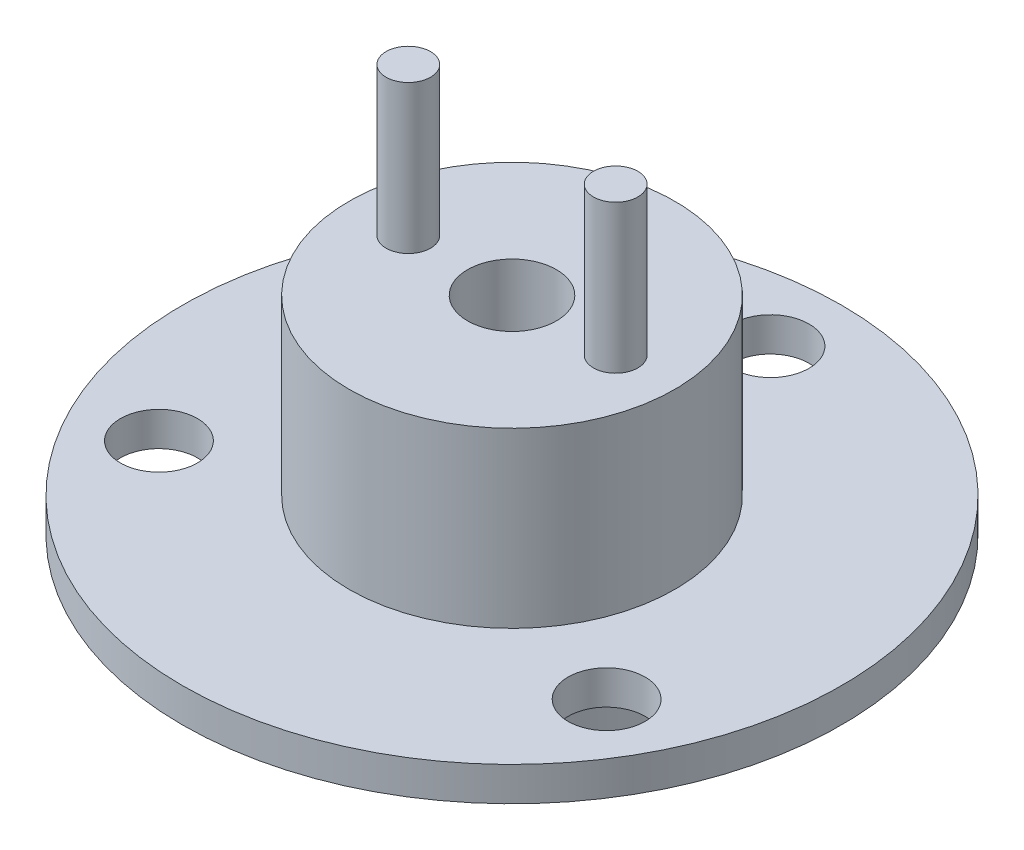
ISO-10303-21;
HEADER;
FILE_DESCRIPTION(('STEP AP214'),'2;1');
FILE_NAME('part.step','',(''),(''),'','','');
FILE_SCHEMA(('AUTOMOTIVE_DESIGN { 1 0 10303 214 1 1 1 1 }'));
ENDSEC;
DATA;
#1=APPLICATION_CONTEXT('core data for automotive mechanical design processes');
#2=APPLICATION_PROTOCOL_DEFINITION('international standard','automotive_design',2000,#1);
#3=PRODUCT_CONTEXT('',#1,'mechanical');
#4=PRODUCT('Part','Part','',(#3));
#5=PRODUCT_RELATED_PRODUCT_CATEGORY('part','',(#4));
#6=PRODUCT_DEFINITION_FORMATION('','',#4);
#7=PRODUCT_DEFINITION_CONTEXT('part definition',#1,'design');
#8=PRODUCT_DEFINITION('design','',#6,#7);
#9=PRODUCT_DEFINITION_SHAPE('','',#8);
#10=(LENGTH_UNIT() NAMED_UNIT(*) SI_UNIT(.MILLI.,.METRE.));
#11=(NAMED_UNIT(*) PLANE_ANGLE_UNIT() SI_UNIT($,.RADIAN.));
#12=(NAMED_UNIT(*) SI_UNIT($,.STERADIAN.) SOLID_ANGLE_UNIT());
#13=UNCERTAINTY_MEASURE_WITH_UNIT(LENGTH_MEASURE(1.E-05),#10,'distance_accuracy_value','');
#14=(GEOMETRIC_REPRESENTATION_CONTEXT(3) GLOBAL_UNCERTAINTY_ASSIGNED_CONTEXT((#13)) GLOBAL_UNIT_ASSIGNED_CONTEXT((#10,
#11,#12)) REPRESENTATION_CONTEXT('',''));
#15=CARTESIAN_POINT('',(0.,0.,0.));
#16=DIRECTION('',(0.,0.,1.));
#17=DIRECTION('',(1.,0.,0.));
#18=AXIS2_PLACEMENT_3D('',#15,#16,#17);
#19=CARTESIAN_POINT('',(0.,19.,0.));
#20=DIRECTION('',(0.,-1.,0.));
#21=DIRECTION('',(0.,0.,-1.));
#22=AXIS2_PLACEMENT_3D('',#19,#20,#21);
#23=CYLINDRICAL_SURFACE('',#22,11.);
#24=CARTESIAN_POINT('',(0.,7.3,0.));
#25=DIRECTION('',(0.,1.,0.));
#26=DIRECTION('',(0.,0.,1.));
#27=AXIS2_PLACEMENT_3D('',#24,#25,#26);
#28=CIRCLE('',#27,11.);
#29=CARTESIAN_POINT('',(0.,7.3,11.));
#30=VERTEX_POINT('',#29);
#31=EDGE_CURVE('E51',#30,#30,#28,.T.);
#32=ORIENTED_EDGE('',*,*,#31,.T.);
#33=EDGE_LOOP('',(#32));
#34=FACE_BOUND('',#33,.T.);
#35=CARTESIAN_POINT('',(0.,19.,0.));
#36=DIRECTION('',(0.,1.,0.));
#37=DIRECTION('',(0.,0.,1.));
#38=AXIS2_PLACEMENT_3D('',#35,#36,#37);
#39=CIRCLE('',#38,11.);
#40=CARTESIAN_POINT('',(0.,19.,11.));
#41=VERTEX_POINT('',#40);
#42=EDGE_CURVE('E43',#41,#41,#39,.T.);
#43=ORIENTED_EDGE('',*,*,#42,.F.);
#44=EDGE_LOOP('',(#43));
#45=FACE_BOUND('',#44,.T.);
#46=ADVANCED_FACE('F36',(#34,#45),#23,.T.);
#47=CARTESIAN_POINT('',(0.,19.,0.));
#48=DIRECTION('',(0.,1.,0.));
#49=DIRECTION('',(0.,0.,1.));
#50=AXIS2_PLACEMENT_3D('',#47,#48,#49);
#51=PLANE('',#50);
#52=CARTESIAN_POINT('',(7.,19.,0.));
#53=DIRECTION('',(0.,1.,0.));
#54=DIRECTION('',(0.,0.,1.));
#55=AXIS2_PLACEMENT_3D('',#52,#53,#54);
#56=CIRCLE('',#55,1.5);
#57=CARTESIAN_POINT('',(7.,19.,1.5));
#58=VERTEX_POINT('',#57);
#59=EDGE_CURVE('E93',#58,#58,#56,.T.);
#60=ORIENTED_EDGE('',*,*,#59,.F.);
#61=EDGE_LOOP('',(#60));
#62=FACE_BOUND('',#61,.T.);
#63=CARTESIAN_POINT('',(-7.,19.,0.));
#64=DIRECTION('',(0.,1.,0.));
#65=DIRECTION('',(0.,0.,1.));
#66=AXIS2_PLACEMENT_3D('',#63,#64,#65);
#67=CIRCLE('',#66,1.5);
#68=CARTESIAN_POINT('',(-7.,19.,1.5));
#69=VERTEX_POINT('',#68);
#70=EDGE_CURVE('E87',#69,#69,#67,.T.);
#71=ORIENTED_EDGE('',*,*,#70,.F.);
#72=EDGE_LOOP('',(#71));
#73=FACE_BOUND('',#72,.T.);
#74=CARTESIAN_POINT('',(0.,19.,0.));
#75=DIRECTION('',(0.,1.,0.));
#76=DIRECTION('',(0.,0.,1.));
#77=AXIS2_PLACEMENT_3D('',#74,#75,#76);
#78=CIRCLE('',#77,3.);
#79=CARTESIAN_POINT('',(0.,19.,3.));
#80=VERTEX_POINT('',#79);
#81=EDGE_CURVE('E83',#80,#80,#78,.T.);
#82=ORIENTED_EDGE('',*,*,#81,.F.);
#83=EDGE_LOOP('',(#82));
#84=FACE_BOUND('',#83,.T.);
#85=ORIENTED_EDGE('',*,*,#42,.T.);
#86=EDGE_LOOP('',(#85));
#87=FACE_BOUND('',#86,.T.);
#88=ADVANCED_FACE('F108',(#62,#73,#84,#87),#51,.T.);
#89=CARTESIAN_POINT('',(0.,7.3,0.));
#90=DIRECTION('',(0.,-1.,0.));
#91=DIRECTION('',(0.,0.,-1.));
#92=AXIS2_PLACEMENT_3D('',#89,#90,#91);
#93=CYLINDRICAL_SURFACE('',#92,22.25);
#94=CARTESIAN_POINT('',(0.,7.3,0.));
#95=DIRECTION('',(0.,1.,0.));
#96=DIRECTION('',(0.,0.,1.));
#97=AXIS2_PLACEMENT_3D('',#94,#95,#96);
#98=CIRCLE('',#97,22.25);
#99=CARTESIAN_POINT('',(0.,7.3,22.25));
#100=VERTEX_POINT('',#99);
#101=EDGE_CURVE('E53',#100,#100,#98,.T.);
#102=ORIENTED_EDGE('',*,*,#101,.F.);
#103=EDGE_LOOP('',(#102));
#104=FACE_BOUND('',#103,.T.);
#105=CARTESIAN_POINT('',(0.,5.,0.));
#106=DIRECTION('',(0.,1.,0.));
#107=DIRECTION('',(0.,0.,1.));
#108=AXIS2_PLACEMENT_3D('',#105,#106,#107);
#109=CIRCLE('',#108,22.25);
#110=CARTESIAN_POINT('',(0.,5.,22.25));
#111=VERTEX_POINT('',#110);
#112=EDGE_CURVE('E58',#111,#111,#109,.T.);
#113=ORIENTED_EDGE('',*,*,#112,.T.);
#114=EDGE_LOOP('',(#113));
#115=FACE_BOUND('',#114,.T.);
#116=ADVANCED_FACE('F111',(#104,#115),#93,.T.);
#117=CARTESIAN_POINT('',(0.,7.3,0.));
#118=DIRECTION('',(0.,1.,0.));
#119=DIRECTION('',(0.,0.,1.));
#120=AXIS2_PLACEMENT_3D('',#117,#118,#119);
#121=PLANE('',#120);
#122=CARTESIAN_POINT('',(15.1121432960384,7.3,8.72500000000008));
#123=DIRECTION('',(0.,-1.,0.));
#124=DIRECTION('',(0.,0.,-1.));
#125=AXIS2_PLACEMENT_3D('',#122,#123,#124);
#126=CIRCLE('',#125,2.6);
#127=CARTESIAN_POINT('',(15.1121432960384,7.3,6.12500000000008));
#128=VERTEX_POINT('',#127);
#129=EDGE_CURVE('E63',#128,#128,#126,.T.);
#130=ORIENTED_EDGE('',*,*,#129,.T.);
#131=EDGE_LOOP('',(#130));
#132=FACE_BOUND('',#131,.T.);
#133=CARTESIAN_POINT('',(-15.1121432960384,7.3,8.72500000000007));
#134=DIRECTION('',(0.,-1.,0.));
#135=DIRECTION('',(0.,0.,-1.));
#136=AXIS2_PLACEMENT_3D('',#133,#134,#135);
#137=CIRCLE('',#136,2.6);
#138=CARTESIAN_POINT('',(-15.1121432960384,7.3,6.12500000000007));
#139=VERTEX_POINT('',#138);
#140=EDGE_CURVE('E75',#139,#139,#137,.T.);
#141=ORIENTED_EDGE('',*,*,#140,.T.);
#142=EDGE_LOOP('',(#141));
#143=FACE_BOUND('',#142,.T.);
#144=CARTESIAN_POINT('',(0.,7.3,-17.45));
#145=DIRECTION('',(0.,-1.,0.));
#146=DIRECTION('',(0.,0.,-1.));
#147=AXIS2_PLACEMENT_3D('',#144,#145,#146);
#148=CIRCLE('',#147,2.6);
#149=CARTESIAN_POINT('',(0.,7.3,-20.05));
#150=VERTEX_POINT('',#149);
#151=EDGE_CURVE('E69',#150,#150,#148,.T.);
#152=ORIENTED_EDGE('',*,*,#151,.T.);
#153=EDGE_LOOP('',(#152));
#154=FACE_BOUND('',#153,.T.);
#155=ORIENTED_EDGE('',*,*,#31,.F.);
#156=EDGE_LOOP('',(#155));
#157=FACE_BOUND('',#156,.T.);
#158=ORIENTED_EDGE('',*,*,#101,.T.);
#159=EDGE_LOOP('',(#158));
#160=FACE_BOUND('',#159,.T.);
#161=ADVANCED_FACE('F142',(#132,#143,#154,#157,#160),#121,.T.);
#162=CARTESIAN_POINT('',(0.,5.,0.));
#163=DIRECTION('',(0.,1.,0.));
#164=DIRECTION('',(0.,0.,1.));
#165=AXIS2_PLACEMENT_3D('',#162,#163,#164);
#166=PLANE('',#165);
#167=CARTESIAN_POINT('',(15.1121432960384,5.,8.72500000000008));
#168=DIRECTION('',(0.,-1.,0.));
#169=DIRECTION('',(0.,0.,-1.));
#170=AXIS2_PLACEMENT_3D('',#167,#168,#169);
#171=CIRCLE('',#170,2.6);
#172=CARTESIAN_POINT('',(15.1121432960384,5.,6.12500000000008));
#173=VERTEX_POINT('',#172);
#174=EDGE_CURVE('E78',#173,#173,#171,.T.);
#175=ORIENTED_EDGE('',*,*,#174,.F.);
#176=EDGE_LOOP('',(#175));
#177=FACE_BOUND('',#176,.T.);
#178=CARTESIAN_POINT('',(-15.1121432960384,5.,8.72500000000007));
#179=DIRECTION('',(0.,-1.,0.));
#180=DIRECTION('',(0.,0.,-1.));
#181=AXIS2_PLACEMENT_3D('',#178,#179,#180);
#182=CIRCLE('',#181,2.6);
#183=CARTESIAN_POINT('',(-15.1121432960384,5.,6.12500000000007));
#184=VERTEX_POINT('',#183);
#185=EDGE_CURVE('E72',#184,#184,#182,.T.);
#186=ORIENTED_EDGE('',*,*,#185,.F.);
#187=EDGE_LOOP('',(#186));
#188=FACE_BOUND('',#187,.T.);
#189=CARTESIAN_POINT('',(0.,5.,-17.45));
#190=DIRECTION('',(0.,-1.,0.));
#191=DIRECTION('',(0.,0.,-1.));
#192=AXIS2_PLACEMENT_3D('',#189,#190,#191);
#193=CIRCLE('',#192,2.6);
#194=CARTESIAN_POINT('',(0.,5.,-20.05));
#195=VERTEX_POINT('',#194);
#196=EDGE_CURVE('E66',#195,#195,#193,.T.);
#197=ORIENTED_EDGE('',*,*,#196,.F.);
#198=EDGE_LOOP('',(#197));
#199=FACE_BOUND('',#198,.T.);
#200=CARTESIAN_POINT('',(0.,5.,0.));
#201=DIRECTION('',(0.,1.,0.));
#202=DIRECTION('',(0.,0.,1.));
#203=AXIS2_PLACEMENT_3D('',#200,#201,#202);
#204=CIRCLE('',#203,11.);
#205=CARTESIAN_POINT('',(0.,5.,11.));
#206=VERTEX_POINT('',#205);
#207=EDGE_CURVE('E10',#206,#206,#204,.T.);
#208=ORIENTED_EDGE('',*,*,#207,.T.);
#209=EDGE_LOOP('',(#208));
#210=FACE_BOUND('',#209,.T.);
#211=ORIENTED_EDGE('',*,*,#112,.F.);
#212=EDGE_LOOP('',(#211));
#213=FACE_BOUND('',#212,.T.);
#214=ADVANCED_FACE('F134',(#177,#188,#199,#210,#213),#166,.F.);
#215=CARTESIAN_POINT('',(0.,0.,0.));
#216=DIRECTION('',(0.,1.,0.));
#217=DIRECTION('',(0.,0.,1.));
#218=AXIS2_PLACEMENT_3D('',#215,#216,#217);
#219=PLANE('',#218);
#220=CARTESIAN_POINT('',(0.,0.,0.));
#221=DIRECTION('',(0.,1.,0.));
#222=DIRECTION('',(0.,0.,1.));
#223=AXIS2_PLACEMENT_3D('',#220,#221,#222);
#224=CIRCLE('',#223,3.);
#225=CARTESIAN_POINT('',(0.,0.,3.));
#226=VERTEX_POINT('',#225);
#227=EDGE_CURVE('E39',#226,#226,#224,.T.);
#228=ORIENTED_EDGE('',*,*,#227,.T.);
#229=EDGE_LOOP('',(#228));
#230=FACE_BOUND('',#229,.T.);
#231=CARTESIAN_POINT('',(0.,0.,0.));
#232=DIRECTION('',(0.,1.,0.));
#233=DIRECTION('',(0.,0.,1.));
#234=AXIS2_PLACEMENT_3D('',#231,#232,#233);
#235=CIRCLE('',#234,11.);
#236=CARTESIAN_POINT('',(0.,0.,11.));
#237=VERTEX_POINT('',#236);
#238=EDGE_CURVE('E48',#237,#237,#235,.T.);
#239=ORIENTED_EDGE('',*,*,#238,.F.);
#240=EDGE_LOOP('',(#239));
#241=FACE_BOUND('',#240,.T.);
#242=ADVANCED_FACE('F125',(#230,#241),#219,.F.);
#243=ORIENTED_EDGE('',*,*,#238,.T.);
#244=EDGE_LOOP('',(#243));
#245=FACE_BOUND('',#244,.T.);
#246=ORIENTED_EDGE('',*,*,#207,.F.);
#247=EDGE_LOOP('',(#246));
#248=FACE_BOUND('',#247,.T.);
#249=ADVANCED_FACE('F120',(#245,#248),#23,.T.);
#250=CARTESIAN_POINT('',(0.,7.3,-17.45));
#251=DIRECTION('',(0.,-1.,0.));
#252=DIRECTION('',(0.,0.,-1.));
#253=AXIS2_PLACEMENT_3D('',#250,#251,#252);
#254=CYLINDRICAL_SURFACE('',#253,2.6);
#255=ORIENTED_EDGE('',*,*,#151,.F.);
#256=EDGE_LOOP('',(#255));
#257=FACE_BOUND('',#256,.T.);
#258=ORIENTED_EDGE('',*,*,#196,.T.);
#259=EDGE_LOOP('',(#258));
#260=FACE_BOUND('',#259,.T.);
#261=ADVANCED_FACE('F124',(#257,#260),#254,.F.);
#262=CARTESIAN_POINT('',(-15.1121432960384,7.3,8.72500000000007));
#263=DIRECTION('',(0.,-1.,0.));
#264=DIRECTION('',(0.,0.,-1.));
#265=AXIS2_PLACEMENT_3D('',#262,#263,#264);
#266=CYLINDRICAL_SURFACE('',#265,2.6);
#267=ORIENTED_EDGE('',*,*,#140,.F.);
#268=EDGE_LOOP('',(#267));
#269=FACE_BOUND('',#268,.T.);
#270=ORIENTED_EDGE('',*,*,#185,.T.);
#271=EDGE_LOOP('',(#270));
#272=FACE_BOUND('',#271,.T.);
#273=ADVANCED_FACE('F131',(#269,#272),#266,.F.);
#274=CARTESIAN_POINT('',(15.1121432960384,7.3,8.72500000000008));
#275=DIRECTION('',(0.,-1.,0.));
#276=DIRECTION('',(0.,0.,-1.));
#277=AXIS2_PLACEMENT_3D('',#274,#275,#276);
#278=CYLINDRICAL_SURFACE('',#277,2.6);
#279=ORIENTED_EDGE('',*,*,#129,.F.);
#280=EDGE_LOOP('',(#279));
#281=FACE_BOUND('',#280,.T.);
#282=ORIENTED_EDGE('',*,*,#174,.T.);
#283=EDGE_LOOP('',(#282));
#284=FACE_BOUND('',#283,.T.);
#285=ADVANCED_FACE('F155',(#281,#284),#278,.F.);
#286=CARTESIAN_POINT('',(0.,-8.30000000000001,0.));
#287=DIRECTION('',(0.,1.,0.));
#288=DIRECTION('',(0.,0.,1.));
#289=AXIS2_PLACEMENT_3D('',#286,#287,#288);
#290=CYLINDRICAL_SURFACE('',#289,3.);
#291=ORIENTED_EDGE('',*,*,#81,.T.);
#292=EDGE_LOOP('',(#291));
#293=FACE_BOUND('',#292,.T.);
#294=ORIENTED_EDGE('',*,*,#227,.F.);
#295=EDGE_LOOP('',(#294));
#296=FACE_BOUND('',#295,.T.);
#297=ADVANCED_FACE('F159',(#293,#296),#290,.F.);
#298=CARTESIAN_POINT('',(-7.,29.,0.));
#299=DIRECTION('',(0.,-1.,0.));
#300=DIRECTION('',(0.,0.,-1.));
#301=AXIS2_PLACEMENT_3D('',#298,#299,#300);
#302=CYLINDRICAL_SURFACE('',#301,1.5);
#303=CARTESIAN_POINT('',(-7.,29.,0.));
#304=DIRECTION('',(0.,1.,0.));
#305=DIRECTION('',(0.,0.,1.));
#306=AXIS2_PLACEMENT_3D('',#303,#304,#305);
#307=CIRCLE('',#306,1.5);
#308=CARTESIAN_POINT('',(-7.,29.,1.5));
#309=VERTEX_POINT('',#308);
#310=EDGE_CURVE('E86',#309,#309,#307,.T.);
#311=ORIENTED_EDGE('',*,*,#310,.F.);
#312=EDGE_LOOP('',(#311));
#313=FACE_BOUND('',#312,.T.);
#314=ORIENTED_EDGE('',*,*,#70,.T.);
#315=EDGE_LOOP('',(#314));
#316=FACE_BOUND('',#315,.T.);
#317=ADVANCED_FACE('F163',(#313,#316),#302,.T.);
#318=CARTESIAN_POINT('',(-7.,29.,0.));
#319=DIRECTION('',(0.,1.,0.));
#320=DIRECTION('',(0.,0.,1.));
#321=AXIS2_PLACEMENT_3D('',#318,#319,#320);
#322=PLANE('',#321);
#323=ORIENTED_EDGE('',*,*,#310,.T.);
#324=EDGE_LOOP('',(#323));
#325=FACE_BOUND('',#324,.T.);
#326=ADVANCED_FACE('F104',(#325),#322,.T.);
#327=CARTESIAN_POINT('',(7.,29.,0.));
#328=DIRECTION('',(0.,-1.,0.));
#329=DIRECTION('',(0.,0.,-1.));
#330=AXIS2_PLACEMENT_3D('',#327,#328,#329);
#331=CYLINDRICAL_SURFACE('',#330,1.5);
#332=CARTESIAN_POINT('',(7.,29.,0.));
#333=DIRECTION('',(0.,1.,0.));
#334=DIRECTION('',(0.,0.,1.));
#335=AXIS2_PLACEMENT_3D('',#332,#333,#334);
#336=CIRCLE('',#335,1.5);
#337=CARTESIAN_POINT('',(7.,29.,1.5));
#338=VERTEX_POINT('',#337);
#339=EDGE_CURVE('E90',#338,#338,#336,.T.);
#340=ORIENTED_EDGE('',*,*,#339,.F.);
#341=EDGE_LOOP('',(#340));
#342=FACE_BOUND('',#341,.T.);
#343=ORIENTED_EDGE('',*,*,#59,.T.);
#344=EDGE_LOOP('',(#343));
#345=FACE_BOUND('',#344,.T.);
#346=ADVANCED_FACE('F101',(#342,#345),#331,.T.);
#347=CARTESIAN_POINT('',(7.,29.,0.));
#348=DIRECTION('',(0.,1.,0.));
#349=DIRECTION('',(0.,0.,1.));
#350=AXIS2_PLACEMENT_3D('',#347,#348,#349);
#351=PLANE('',#350);
#352=ORIENTED_EDGE('',*,*,#339,.T.);
#353=EDGE_LOOP('',(#352));
#354=FACE_BOUND('',#353,.T.);
#355=ADVANCED_FACE('F99',(#354),#351,.T.);
#356=CLOSED_SHELL('',(#46,#88,#116,#161,#214,#242,#249,#261,#273,#285,#297,#317,#326,#346,#355));
#357=MANIFOLD_SOLID_BREP('B2',#356);
#358=ADVANCED_BREP_SHAPE_REPRESENTATION('',(#18,#357),#14);
#359=SHAPE_DEFINITION_REPRESENTATION(#9,#358);
ENDSEC;
END-ISO-10303-21;
